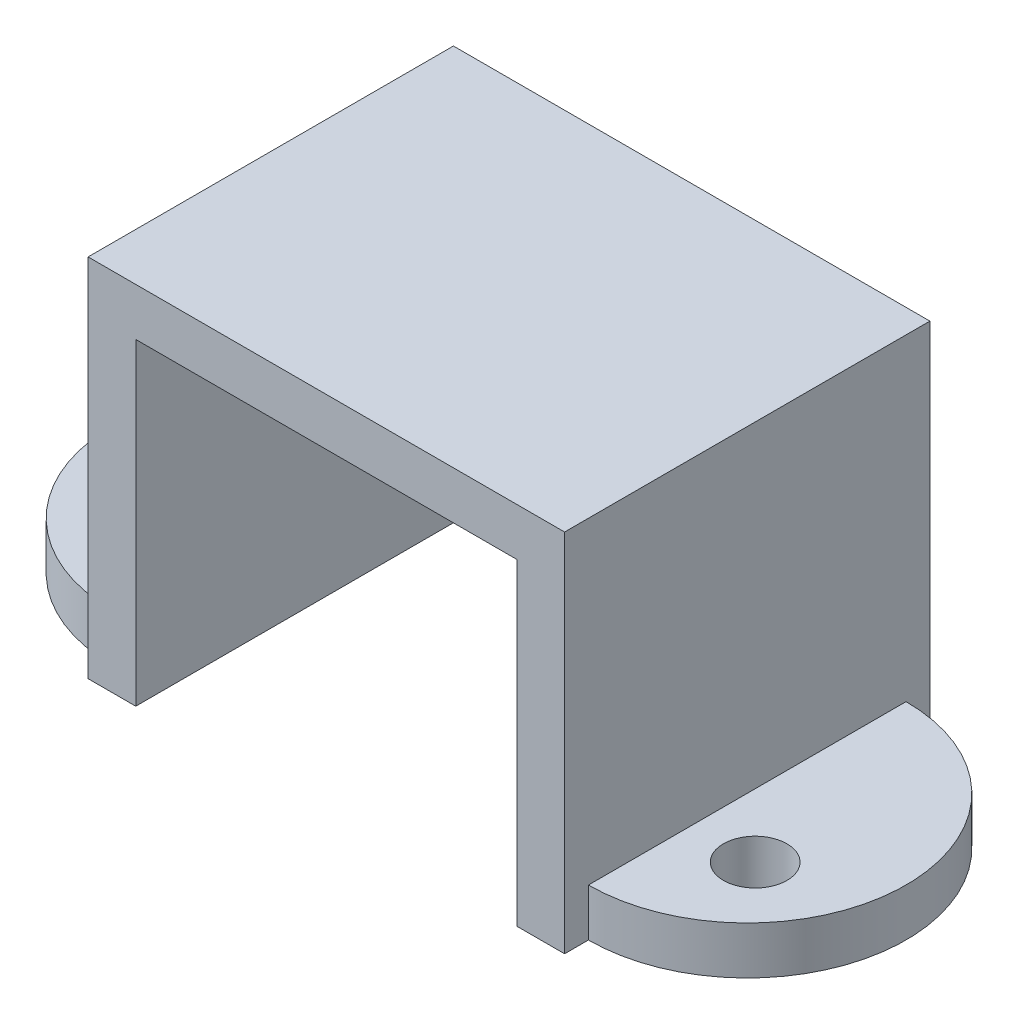
ISO-10303-21;
HEADER;
FILE_DESCRIPTION(('STEP AP214'),'2;1');
FILE_NAME('part.step','',(''),(''),'','','');
FILE_SCHEMA(('AUTOMOTIVE_DESIGN { 1 0 10303 214 1 1 1 1 }'));
ENDSEC;
DATA;
#1=APPLICATION_CONTEXT('core data for automotive mechanical design processes');
#2=APPLICATION_PROTOCOL_DEFINITION('international standard','automotive_design',2000,#1);
#3=PRODUCT_CONTEXT('',#1,'mechanical');
#4=PRODUCT('Part','Part','',(#3));
#5=PRODUCT_RELATED_PRODUCT_CATEGORY('part','',(#4));
#6=PRODUCT_DEFINITION_FORMATION('','',#4);
#7=PRODUCT_DEFINITION_CONTEXT('part definition',#1,'design');
#8=PRODUCT_DEFINITION('design','',#6,#7);
#9=PRODUCT_DEFINITION_SHAPE('','',#8);
#10=(LENGTH_UNIT() NAMED_UNIT(*) SI_UNIT(.MILLI.,.METRE.));
#11=(NAMED_UNIT(*) PLANE_ANGLE_UNIT() SI_UNIT($,.RADIAN.));
#12=(NAMED_UNIT(*) SI_UNIT($,.STERADIAN.) SOLID_ANGLE_UNIT());
#13=UNCERTAINTY_MEASURE_WITH_UNIT(LENGTH_MEASURE(1.E-05),#10,'distance_accuracy_value','');
#14=(GEOMETRIC_REPRESENTATION_CONTEXT(3) GLOBAL_UNCERTAINTY_ASSIGNED_CONTEXT((#13)) GLOBAL_UNIT_ASSIGNED_CONTEXT((#10,
#11,#12)) REPRESENTATION_CONTEXT('',''));
#15=CARTESIAN_POINT('',(0.,0.,0.));
#16=DIRECTION('',(0.,0.,1.));
#17=DIRECTION('',(1.,0.,0.));
#18=AXIS2_PLACEMENT_3D('',#15,#16,#17);
#19=CARTESIAN_POINT('',(-7.5,0.,-11.5));
#20=DIRECTION('',(-1.,0.,0.));
#21=DIRECTION('',(0.,-1.,0.));
#22=AXIS2_PLACEMENT_3D('',#19,#20,#21);
#23=PLANE('',#22);
#24=DIRECTION('',(0.,0.,1.));
#25=VECTOR('',#24,1.);
#26=CARTESIAN_POINT('',(-7.5,-5.75,-11.5));
#27=LINE('',#26,#25);
#28=CARTESIAN_POINT('',(-7.5,-5.75,-11.5));
#29=VERTEX_POINT('',#28);
#30=CARTESIAN_POINT('',(-7.5,-5.75,-10.75));
#31=VERTEX_POINT('',#30);
#32=EDGE_CURVE('E214',#29,#31,#27,.T.);
#33=ORIENTED_EDGE('',*,*,#32,.T.);
#34=DIRECTION('',(0.,-1.,0.));
#35=VECTOR('',#34,1.);
#36=CARTESIAN_POINT('',(-7.5,-4.25,-10.75));
#37=LINE('',#36,#35);
#38=CARTESIAN_POINT('',(-7.5,-4.25,-10.75));
#39=VERTEX_POINT('',#38);
#40=EDGE_CURVE('E162',#39,#31,#37,.T.);
#41=ORIENTED_EDGE('',*,*,#40,.F.);
#42=DIRECTION('',(0.,0.,-1.));
#43=VECTOR('',#42,1.);
#44=CARTESIAN_POINT('',(-7.5,-4.25,0.));
#45=LINE('',#44,#43);
#46=CARTESIAN_POINT('',(-7.5,-4.25,-0.749999999999999));
#47=VERTEX_POINT('',#46);
#48=EDGE_CURVE('E62',#47,#39,#45,.T.);
#49=ORIENTED_EDGE('',*,*,#48,.F.);
#50=DIRECTION('',(0.,-1.,0.));
#51=VECTOR('',#50,1.);
#52=CARTESIAN_POINT('',(-7.5,-4.25,-0.75));
#53=LINE('',#52,#51);
#54=CARTESIAN_POINT('',(-7.5,-5.75,-0.75));
#55=VERTEX_POINT('',#54);
#56=EDGE_CURVE('E167',#47,#55,#53,.T.);
#57=ORIENTED_EDGE('',*,*,#56,.T.);
#58=CARTESIAN_POINT('',(-7.5,-5.75,0.));
#59=VERTEX_POINT('',#58);
#60=EDGE_CURVE('E216',#55,#59,#27,.T.);
#61=ORIENTED_EDGE('',*,*,#60,.T.);
#62=DIRECTION('',(0.,-1.,0.));
#63=VECTOR('',#62,1.);
#64=CARTESIAN_POINT('',(-7.5,0.,0.));
#65=LINE('',#64,#63);
#66=CARTESIAN_POINT('',(-7.5,5.75,0.));
#67=VERTEX_POINT('',#66);
#68=EDGE_CURVE('E203',#67,#59,#65,.T.);
#69=ORIENTED_EDGE('',*,*,#68,.F.);
#70=DIRECTION('',(0.,0.,1.));
#71=VECTOR('',#70,1.);
#72=CARTESIAN_POINT('',(-7.5,5.75,-11.5));
#73=LINE('',#72,#71);
#74=CARTESIAN_POINT('',(-7.5,5.75,-11.5));
#75=VERTEX_POINT('',#74);
#76=EDGE_CURVE('E217',#75,#67,#73,.T.);
#77=ORIENTED_EDGE('',*,*,#76,.F.);
#78=DIRECTION('',(0.,-1.,0.));
#79=VECTOR('',#78,1.);
#80=CARTESIAN_POINT('',(-7.5,0.,-11.5));
#81=LINE('',#80,#79);
#82=EDGE_CURVE('E183',#75,#29,#81,.T.);
#83=ORIENTED_EDGE('',*,*,#82,.T.);
#84=EDGE_LOOP('',(#33,#41,#49,#57,#61,#69,#77,#83));
#85=FACE_BOUND('',#84,.T.);
#86=ADVANCED_FACE('F37',(#85),#23,.T.);
#87=CARTESIAN_POINT('',(6.,0.,-11.5));
#88=DIRECTION('',(1.,0.,0.));
#89=DIRECTION('',(0.,0.,-1.));
#90=AXIS2_PLACEMENT_3D('',#87,#88,#89);
#91=PLANE('',#90);
#92=DIRECTION('',(0.,1.,0.));
#93=VECTOR('',#92,1.);
#94=CARTESIAN_POINT('',(6.,0.,0.));
#95=LINE('',#94,#93);
#96=CARTESIAN_POINT('',(6.,-5.75,0.));
#97=VERTEX_POINT('',#96);
#98=CARTESIAN_POINT('',(6.,4.25000000000001,0.));
#99=VERTEX_POINT('',#98);
#100=EDGE_CURVE('E169',#97,#99,#95,.T.);
#101=ORIENTED_EDGE('',*,*,#100,.T.);
#102=DIRECTION('',(0.,0.,1.));
#103=VECTOR('',#102,1.);
#104=CARTESIAN_POINT('',(6.,4.25000000000001,-11.5));
#105=LINE('',#104,#103);
#106=CARTESIAN_POINT('',(6.,4.25000000000001,-11.5));
#107=VERTEX_POINT('',#106);
#108=EDGE_CURVE('E11',#107,#99,#105,.T.);
#109=ORIENTED_EDGE('',*,*,#108,.F.);
#110=DIRECTION('',(0.,1.,0.));
#111=VECTOR('',#110,1.);
#112=CARTESIAN_POINT('',(6.,0.,-11.5));
#113=LINE('',#112,#111);
#114=CARTESIAN_POINT('',(6.,-5.75,-11.5));
#115=VERTEX_POINT('',#114);
#116=EDGE_CURVE('E172',#115,#107,#113,.T.);
#117=ORIENTED_EDGE('',*,*,#116,.F.);
#118=DIRECTION('',(0.,0.,1.));
#119=VECTOR('',#118,1.);
#120=CARTESIAN_POINT('',(6.,-5.75,-11.5));
#121=LINE('',#120,#119);
#122=EDGE_CURVE('E41',#115,#97,#121,.T.);
#123=ORIENTED_EDGE('',*,*,#122,.T.);
#124=EDGE_LOOP('',(#101,#109,#117,#123));
#125=FACE_BOUND('',#124,.T.);
#126=ADVANCED_FACE('F39',(#125),#91,.F.);
#127=CARTESIAN_POINT('',(0.,4.25000000000001,-11.5));
#128=DIRECTION('',(0.,-1.,0.));
#129=DIRECTION('',(0.,0.,-1.));
#130=AXIS2_PLACEMENT_3D('',#127,#128,#129);
#131=PLANE('',#130);
#132=DIRECTION('',(1.,0.,0.));
#133=VECTOR('',#132,1.);
#134=CARTESIAN_POINT('',(0.,4.25000000000001,0.));
#135=LINE('',#134,#133);
#136=CARTESIAN_POINT('',(-6.,4.25000000000001,0.));
#137=VERTEX_POINT('',#136);
#138=EDGE_CURVE('E175',#137,#99,#135,.T.);
#139=ORIENTED_EDGE('',*,*,#138,.F.);
#140=DIRECTION('',(0.,0.,1.));
#141=VECTOR('',#140,1.);
#142=CARTESIAN_POINT('',(-6.,4.25000000000001,-11.5));
#143=LINE('',#142,#141);
#144=CARTESIAN_POINT('',(-6.,4.25000000000001,-11.5));
#145=VERTEX_POINT('',#144);
#146=EDGE_CURVE('E46',#145,#137,#143,.T.);
#147=ORIENTED_EDGE('',*,*,#146,.F.);
#148=DIRECTION('',(1.,0.,0.));
#149=VECTOR('',#148,1.);
#150=CARTESIAN_POINT('',(0.,4.25000000000001,-11.5));
#151=LINE('',#150,#149);
#152=EDGE_CURVE('E189',#145,#107,#151,.T.);
#153=ORIENTED_EDGE('',*,*,#152,.T.);
#154=ORIENTED_EDGE('',*,*,#108,.T.);
#155=EDGE_LOOP('',(#139,#147,#153,#154));
#156=FACE_BOUND('',#155,.T.);
#157=ADVANCED_FACE('F259',(#156),#131,.T.);
#158=CARTESIAN_POINT('',(-6.,0.,-11.5));
#159=DIRECTION('',(1.,0.,0.));
#160=DIRECTION('',(0.,0.,-1.));
#161=AXIS2_PLACEMENT_3D('',#158,#159,#160);
#162=PLANE('',#161);
#163=DIRECTION('',(0.,1.,0.));
#164=VECTOR('',#163,1.);
#165=CARTESIAN_POINT('',(-6.,0.,0.));
#166=LINE('',#165,#164);
#167=CARTESIAN_POINT('',(-6.,-5.75,0.));
#168=VERTEX_POINT('',#167);
#169=EDGE_CURVE('E206',#168,#137,#166,.T.);
#170=ORIENTED_EDGE('',*,*,#169,.F.);
#171=DIRECTION('',(0.,0.,1.));
#172=VECTOR('',#171,1.);
#173=CARTESIAN_POINT('',(-6.,-5.75,-11.5));
#174=LINE('',#173,#172);
#175=CARTESIAN_POINT('',(-6.,-5.75,-11.5));
#176=VERTEX_POINT('',#175);
#177=EDGE_CURVE('E212',#176,#168,#174,.T.);
#178=ORIENTED_EDGE('',*,*,#177,.F.);
#179=DIRECTION('',(0.,1.,0.));
#180=VECTOR('',#179,1.);
#181=CARTESIAN_POINT('',(-6.,0.,-11.5));
#182=LINE('',#181,#180);
#183=EDGE_CURVE('E186',#176,#145,#182,.T.);
#184=ORIENTED_EDGE('',*,*,#183,.T.);
#185=ORIENTED_EDGE('',*,*,#146,.T.);
#186=EDGE_LOOP('',(#170,#178,#184,#185));
#187=FACE_BOUND('',#186,.T.);
#188=ADVANCED_FACE('F346',(#187),#162,.T.);
#189=CARTESIAN_POINT('',(0.,-5.75,-11.5));
#190=DIRECTION('',(0.,-1.,0.));
#191=DIRECTION('',(0.,0.,-1.));
#192=AXIS2_PLACEMENT_3D('',#189,#190,#191);
#193=PLANE('',#192);
#194=DIRECTION('',(1.,0.,0.));
#195=VECTOR('',#194,1.);
#196=CARTESIAN_POINT('',(0.,-5.75,0.));
#197=LINE('',#196,#195);
#198=EDGE_CURVE('E198',#59,#168,#197,.T.);
#199=ORIENTED_EDGE('',*,*,#198,.F.);
#200=ORIENTED_EDGE('',*,*,#60,.F.);
#201=CARTESIAN_POINT('',(-7.5,-5.75,-5.75));
#202=DIRECTION('',(0.,-1.,0.));
#203=DIRECTION('',(0.,0.,-1.));
#204=AXIS2_PLACEMENT_3D('',#201,#202,#203);
#205=CIRCLE('',#204,5.);
#206=EDGE_CURVE('E159',#31,#55,#205,.F.);
#207=ORIENTED_EDGE('',*,*,#206,.F.);
#208=ORIENTED_EDGE('',*,*,#32,.F.);
#209=DIRECTION('',(1.,0.,0.));
#210=VECTOR('',#209,1.);
#211=CARTESIAN_POINT('',(0.,-5.75,-11.5));
#212=LINE('',#211,#210);
#213=EDGE_CURVE('E179',#29,#176,#212,.T.);
#214=ORIENTED_EDGE('',*,*,#213,.T.);
#215=ORIENTED_EDGE('',*,*,#177,.T.);
#216=EDGE_LOOP('',(#199,#200,#207,#208,#214,#215));
#217=FACE_BOUND('',#216,.T.);
#218=CARTESIAN_POINT('',(-9.5,-5.75,-4.));
#219=DIRECTION('',(0.,-1.,0.));
#220=DIRECTION('',(0.,0.,-1.));
#221=AXIS2_PLACEMENT_3D('',#218,#219,#220);
#222=CIRCLE('',#221,1.);
#223=CARTESIAN_POINT('',(-9.5,-5.75,-5.));
#224=VERTEX_POINT('',#223);
#225=EDGE_CURVE('E153',#224,#224,#222,.T.);
#226=ORIENTED_EDGE('',*,*,#225,.F.);
#227=EDGE_LOOP('',(#226));
#228=FACE_BOUND('',#227,.T.);
#229=ADVANCED_FACE('F238',(#217,#228),#193,.T.);
#230=CARTESIAN_POINT('',(0.,5.75,-11.5));
#231=DIRECTION('',(0.,-1.,0.));
#232=DIRECTION('',(0.,0.,-1.));
#233=AXIS2_PLACEMENT_3D('',#230,#231,#232);
#234=PLANE('',#233);
#235=DIRECTION('',(1.,0.,0.));
#236=VECTOR('',#235,1.);
#237=CARTESIAN_POINT('',(0.,5.75,0.));
#238=LINE('',#237,#236);
#239=CARTESIAN_POINT('',(7.5,5.75,0.));
#240=VERTEX_POINT('',#239);
#241=EDGE_CURVE('E201',#67,#240,#238,.T.);
#242=ORIENTED_EDGE('',*,*,#241,.T.);
#243=DIRECTION('',(0.,0.,1.));
#244=VECTOR('',#243,1.);
#245=CARTESIAN_POINT('',(7.5,5.75,-11.5));
#246=LINE('',#245,#244);
#247=CARTESIAN_POINT('',(7.5,5.75,-11.5));
#248=VERTEX_POINT('',#247);
#249=EDGE_CURVE('E219',#248,#240,#246,.T.);
#250=ORIENTED_EDGE('',*,*,#249,.F.);
#251=DIRECTION('',(1.,0.,0.));
#252=VECTOR('',#251,1.);
#253=CARTESIAN_POINT('',(0.,5.75,-11.5));
#254=LINE('',#253,#252);
#255=EDGE_CURVE('E181',#75,#248,#254,.T.);
#256=ORIENTED_EDGE('',*,*,#255,.F.);
#257=ORIENTED_EDGE('',*,*,#76,.T.);
#258=EDGE_LOOP('',(#242,#250,#256,#257));
#259=FACE_BOUND('',#258,.T.);
#260=ADVANCED_FACE('F262',(#259),#234,.F.);
#261=CARTESIAN_POINT('',(7.5,0.,-11.5));
#262=DIRECTION('',(-1.,0.,0.));
#263=DIRECTION('',(0.,-1.,0.));
#264=AXIS2_PLACEMENT_3D('',#261,#262,#263);
#265=PLANE('',#264);
#266=DIRECTION('',(0.,0.,-1.));
#267=VECTOR('',#266,1.);
#268=CARTESIAN_POINT('',(7.5,-4.25,0.));
#269=LINE('',#268,#267);
#270=CARTESIAN_POINT('',(7.5,-4.25,-0.75));
#271=VERTEX_POINT('',#270);
#272=CARTESIAN_POINT('',(7.5,-4.25,-10.75));
#273=VERTEX_POINT('',#272);
#274=EDGE_CURVE('E140',#271,#273,#269,.T.);
#275=ORIENTED_EDGE('',*,*,#274,.T.);
#276=DIRECTION('',(0.,-1.,0.));
#277=VECTOR('',#276,1.);
#278=CARTESIAN_POINT('',(7.5,-4.25,-10.75));
#279=LINE('',#278,#277);
#280=CARTESIAN_POINT('',(7.5,-5.75,-10.75));
#281=VERTEX_POINT('',#280);
#282=EDGE_CURVE('E128',#273,#281,#279,.T.);
#283=ORIENTED_EDGE('',*,*,#282,.T.);
#284=DIRECTION('',(0.,0.,1.));
#285=VECTOR('',#284,1.);
#286=CARTESIAN_POINT('',(7.5,-5.75,-11.5));
#287=LINE('',#286,#285);
#288=CARTESIAN_POINT('',(7.5,-5.75,-11.5));
#289=VERTEX_POINT('',#288);
#290=EDGE_CURVE('E221',#289,#281,#287,.T.);
#291=ORIENTED_EDGE('',*,*,#290,.F.);
#292=DIRECTION('',(0.,-1.,0.));
#293=VECTOR('',#292,1.);
#294=CARTESIAN_POINT('',(7.5,0.,-11.5));
#295=LINE('',#294,#293);
#296=EDGE_CURVE('E178',#248,#289,#295,.T.);
#297=ORIENTED_EDGE('',*,*,#296,.F.);
#298=ORIENTED_EDGE('',*,*,#249,.T.);
#299=DIRECTION('',(0.,-1.,0.));
#300=VECTOR('',#299,1.);
#301=CARTESIAN_POINT('',(7.5,0.,0.));
#302=LINE('',#301,#300);
#303=CARTESIAN_POINT('',(7.5,-5.75,0.));
#304=VERTEX_POINT('',#303);
#305=EDGE_CURVE('E197',#240,#304,#302,.T.);
#306=ORIENTED_EDGE('',*,*,#305,.T.);
#307=CARTESIAN_POINT('',(7.5,-5.75,-0.750000000000001));
#308=VERTEX_POINT('',#307);
#309=EDGE_CURVE('E222',#308,#304,#287,.T.);
#310=ORIENTED_EDGE('',*,*,#309,.F.);
#311=DIRECTION('',(0.,-1.,0.));
#312=VECTOR('',#311,1.);
#313=CARTESIAN_POINT('',(7.5,-4.25,-0.75));
#314=LINE('',#313,#312);
#315=EDGE_CURVE('E136',#271,#308,#314,.T.);
#316=ORIENTED_EDGE('',*,*,#315,.F.);
#317=EDGE_LOOP('',(#275,#283,#291,#297,#298,#306,#310,#316));
#318=FACE_BOUND('',#317,.T.);
#319=ADVANCED_FACE('F142',(#318),#265,.F.);
#320=EDGE_CURVE('E194',#97,#304,#197,.T.);
#321=ORIENTED_EDGE('',*,*,#320,.F.);
#322=ORIENTED_EDGE('',*,*,#122,.F.);
#323=EDGE_CURVE('E174',#115,#289,#212,.T.);
#324=ORIENTED_EDGE('',*,*,#323,.T.);
#325=ORIENTED_EDGE('',*,*,#290,.T.);
#326=CARTESIAN_POINT('',(7.5,-5.75,-5.75));
#327=DIRECTION('',(0.,-1.,0.));
#328=DIRECTION('',(0.,0.,-1.));
#329=AXIS2_PLACEMENT_3D('',#326,#327,#328);
#330=CIRCLE('',#329,5.);
#331=EDGE_CURVE('E54',#281,#308,#330,.T.);
#332=ORIENTED_EDGE('',*,*,#331,.T.);
#333=ORIENTED_EDGE('',*,*,#309,.T.);
#334=EDGE_LOOP('',(#321,#322,#324,#325,#332,#333));
#335=FACE_BOUND('',#334,.T.);
#336=CARTESIAN_POINT('',(9.5,-5.75,-4.));
#337=DIRECTION('',(0.,-1.,0.));
#338=DIRECTION('',(0.,0.,-1.));
#339=AXIS2_PLACEMENT_3D('',#336,#337,#338);
#340=CIRCLE('',#339,1.);
#341=CARTESIAN_POINT('',(9.5,-5.75,-5.));
#342=VERTEX_POINT('',#341);
#343=EDGE_CURVE('E149',#342,#342,#340,.F.);
#344=ORIENTED_EDGE('',*,*,#343,.T.);
#345=EDGE_LOOP('',(#344));
#346=FACE_BOUND('',#345,.T.);
#347=ADVANCED_FACE('F233',(#335,#346),#193,.T.);
#348=CARTESIAN_POINT('',(0.,0.,-11.5));
#349=DIRECTION('',(0.,0.,1.));
#350=DIRECTION('',(1.,0.,0.));
#351=AXIS2_PLACEMENT_3D('',#348,#349,#350);
#352=PLANE('',#351);
#353=ORIENTED_EDGE('',*,*,#116,.T.);
#354=ORIENTED_EDGE('',*,*,#152,.F.);
#355=ORIENTED_EDGE('',*,*,#183,.F.);
#356=ORIENTED_EDGE('',*,*,#213,.F.);
#357=ORIENTED_EDGE('',*,*,#82,.F.);
#358=ORIENTED_EDGE('',*,*,#255,.T.);
#359=ORIENTED_EDGE('',*,*,#296,.T.);
#360=ORIENTED_EDGE('',*,*,#323,.F.);
#361=EDGE_LOOP('',(#353,#354,#355,#356,#357,#358,#359,#360));
#362=FACE_BOUND('',#361,.T.);
#363=ADVANCED_FACE('F236',(#362),#352,.F.);
#364=CARTESIAN_POINT('',(0.,0.,0.));
#365=DIRECTION('',(0.,0.,1.));
#366=DIRECTION('',(1.,0.,0.));
#367=AXIS2_PLACEMENT_3D('',#364,#365,#366);
#368=PLANE('',#367);
#369=ORIENTED_EDGE('',*,*,#100,.F.);
#370=ORIENTED_EDGE('',*,*,#320,.T.);
#371=ORIENTED_EDGE('',*,*,#305,.F.);
#372=ORIENTED_EDGE('',*,*,#241,.F.);
#373=ORIENTED_EDGE('',*,*,#68,.T.);
#374=ORIENTED_EDGE('',*,*,#198,.T.);
#375=ORIENTED_EDGE('',*,*,#169,.T.);
#376=ORIENTED_EDGE('',*,*,#138,.T.);
#377=EDGE_LOOP('',(#369,#370,#371,#372,#373,#374,#375,#376));
#378=FACE_BOUND('',#377,.T.);
#379=ADVANCED_FACE('F230',(#378),#368,.T.);
#380=CARTESIAN_POINT('',(-7.5,-4.25,-5.75));
#381=DIRECTION('',(0.,-1.,0.));
#382=DIRECTION('',(0.,0.,-1.));
#383=AXIS2_PLACEMENT_3D('',#380,#381,#382);
#384=CYLINDRICAL_SURFACE('',#383,5.);
#385=ORIENTED_EDGE('',*,*,#206,.T.);
#386=ORIENTED_EDGE('',*,*,#56,.F.);
#387=CARTESIAN_POINT('',(-7.5,-4.25,-5.75));
#388=DIRECTION('',(0.,-1.,0.));
#389=DIRECTION('',(0.,0.,-1.));
#390=AXIS2_PLACEMENT_3D('',#387,#388,#389);
#391=CIRCLE('',#390,5.);
#392=EDGE_CURVE('E158',#39,#47,#391,.F.);
#393=ORIENTED_EDGE('',*,*,#392,.F.);
#394=ORIENTED_EDGE('',*,*,#40,.T.);
#395=EDGE_LOOP('',(#385,#386,#393,#394));
#396=FACE_BOUND('',#395,.T.);
#397=ADVANCED_FACE('F290',(#396),#384,.T.);
#398=CARTESIAN_POINT('',(-9.5,-4.25,-4.));
#399=DIRECTION('',(0.,-1.,0.));
#400=DIRECTION('',(0.,0.,-1.));
#401=AXIS2_PLACEMENT_3D('',#398,#399,#400);
#402=CYLINDRICAL_SURFACE('',#401,1.);
#403=CARTESIAN_POINT('',(-9.5,-4.25,-4.));
#404=DIRECTION('',(0.,-1.,0.));
#405=DIRECTION('',(0.,0.,-1.));
#406=AXIS2_PLACEMENT_3D('',#403,#404,#405);
#407=CIRCLE('',#406,1.);
#408=CARTESIAN_POINT('',(-9.5,-4.25,-5.));
#409=VERTEX_POINT('',#408);
#410=EDGE_CURVE('E155',#409,#409,#407,.T.);
#411=ORIENTED_EDGE('',*,*,#410,.F.);
#412=EDGE_LOOP('',(#411));
#413=FACE_BOUND('',#412,.T.);
#414=ORIENTED_EDGE('',*,*,#225,.T.);
#415=EDGE_LOOP('',(#414));
#416=FACE_BOUND('',#415,.T.);
#417=ADVANCED_FACE('F251',(#413,#416),#402,.F.);
#418=CARTESIAN_POINT('',(0.,-4.25,0.));
#419=DIRECTION('',(0.,-1.,0.));
#420=DIRECTION('',(0.,0.,-1.));
#421=AXIS2_PLACEMENT_3D('',#418,#419,#420);
#422=PLANE('',#421);
#423=ORIENTED_EDGE('',*,*,#410,.T.);
#424=EDGE_LOOP('',(#423));
#425=FACE_BOUND('',#424,.T.);
#426=ORIENTED_EDGE('',*,*,#392,.T.);
#427=ORIENTED_EDGE('',*,*,#48,.T.);
#428=EDGE_LOOP('',(#426,#427));
#429=FACE_BOUND('',#428,.T.);
#430=ADVANCED_FACE('F243',(#425,#429),#422,.F.);
#431=CARTESIAN_POINT('',(9.5,-4.25,-4.));
#432=DIRECTION('',(0.,-1.,0.));
#433=DIRECTION('',(0.,0.,-1.));
#434=AXIS2_PLACEMENT_3D('',#431,#432,#433);
#435=CYLINDRICAL_SURFACE('',#434,1.);
#436=CARTESIAN_POINT('',(9.5,-4.25,-4.));
#437=DIRECTION('',(0.,-1.,0.));
#438=DIRECTION('',(0.,0.,-1.));
#439=AXIS2_PLACEMENT_3D('',#436,#437,#438);
#440=CIRCLE('',#439,1.);
#441=CARTESIAN_POINT('',(9.5,-4.25,-5.));
#442=VERTEX_POINT('',#441);
#443=EDGE_CURVE('E144',#442,#442,#440,.F.);
#444=ORIENTED_EDGE('',*,*,#443,.T.);
#445=EDGE_LOOP('',(#444));
#446=FACE_BOUND('',#445,.T.);
#447=ORIENTED_EDGE('',*,*,#343,.F.);
#448=EDGE_LOOP('',(#447));
#449=FACE_BOUND('',#448,.T.);
#450=ADVANCED_FACE('F241',(#446,#449),#435,.F.);
#451=CARTESIAN_POINT('',(7.5,-4.25,-5.75));
#452=DIRECTION('',(0.,-1.,0.));
#453=DIRECTION('',(0.,0.,-1.));
#454=AXIS2_PLACEMENT_3D('',#451,#452,#453);
#455=CYLINDRICAL_SURFACE('',#454,5.);
#456=ORIENTED_EDGE('',*,*,#331,.F.);
#457=ORIENTED_EDGE('',*,*,#282,.F.);
#458=CARTESIAN_POINT('',(7.5,-4.25,-5.75));
#459=DIRECTION('',(0.,-1.,0.));
#460=DIRECTION('',(0.,0.,-1.));
#461=AXIS2_PLACEMENT_3D('',#458,#459,#460);
#462=CIRCLE('',#461,5.);
#463=EDGE_CURVE('E131',#273,#271,#462,.T.);
#464=ORIENTED_EDGE('',*,*,#463,.T.);
#465=ORIENTED_EDGE('',*,*,#315,.T.);
#466=EDGE_LOOP('',(#456,#457,#464,#465));
#467=FACE_BOUND('',#466,.T.);
#468=ADVANCED_FACE('F130',(#467),#455,.T.);
#469=CARTESIAN_POINT('',(0.,-4.25,0.));
#470=DIRECTION('',(0.,-1.,0.));
#471=DIRECTION('',(0.,0.,-1.));
#472=AXIS2_PLACEMENT_3D('',#469,#470,#471);
#473=PLANE('',#472);
#474=ORIENTED_EDGE('',*,*,#443,.F.);
#475=EDGE_LOOP('',(#474));
#476=FACE_BOUND('',#475,.T.);
#477=ORIENTED_EDGE('',*,*,#274,.F.);
#478=ORIENTED_EDGE('',*,*,#463,.F.);
#479=EDGE_LOOP('',(#477,#478));
#480=FACE_BOUND('',#479,.T.);
#481=ADVANCED_FACE('F139',(#476,#480),#473,.F.);
#482=CLOSED_SHELL('',(#86,#126,#157,#188,#229,#260,#319,#347,#363,#379,#397,#417,#430,#450,#468,#481));
#483=MANIFOLD_SOLID_BREP('B2',#482);
#484=ADVANCED_BREP_SHAPE_REPRESENTATION('',(#18,#483),#14);
#485=SHAPE_DEFINITION_REPRESENTATION(#9,#484);
ENDSEC;
END-ISO-10303-21;
